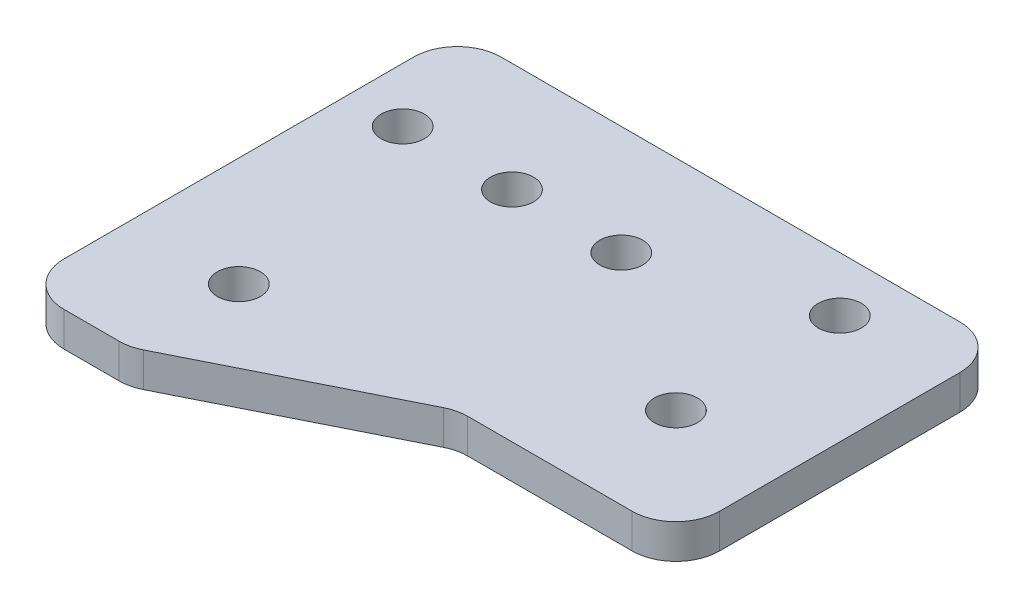
ISO-10303-21;
HEADER;
FILE_DESCRIPTION(('STEP AP214'),'2;1');
FILE_NAME('part.step','',(''),(''),'','','');
FILE_SCHEMA(('AUTOMOTIVE_DESIGN { 1 0 10303 214 1 1 1 1 }'));
ENDSEC;
DATA;
#1=APPLICATION_CONTEXT('core data for automotive mechanical design processes');
#2=APPLICATION_PROTOCOL_DEFINITION('international standard','automotive_design',2000,#1);
#3=PRODUCT_CONTEXT('',#1,'mechanical');
#4=PRODUCT('Part','Part','',(#3));
#5=PRODUCT_RELATED_PRODUCT_CATEGORY('part','',(#4));
#6=PRODUCT_DEFINITION_FORMATION('','',#4);
#7=PRODUCT_DEFINITION_CONTEXT('part definition',#1,'design');
#8=PRODUCT_DEFINITION('design','',#6,#7);
#9=PRODUCT_DEFINITION_SHAPE('','',#8);
#10=(LENGTH_UNIT() NAMED_UNIT(*) SI_UNIT(.MILLI.,.METRE.));
#11=(NAMED_UNIT(*) PLANE_ANGLE_UNIT() SI_UNIT($,.RADIAN.));
#12=(NAMED_UNIT(*) SI_UNIT($,.STERADIAN.) SOLID_ANGLE_UNIT());
#13=UNCERTAINTY_MEASURE_WITH_UNIT(LENGTH_MEASURE(1.E-05),#10,'distance_accuracy_value','');
#14=(GEOMETRIC_REPRESENTATION_CONTEXT(3) GLOBAL_UNCERTAINTY_ASSIGNED_CONTEXT((#13)) GLOBAL_UNIT_ASSIGNED_CONTEXT((#10,
#11,#12)) REPRESENTATION_CONTEXT('',''));
#15=CARTESIAN_POINT('',(0.,0.,0.));
#16=DIRECTION('',(0.,0.,1.));
#17=DIRECTION('',(1.,0.,0.));
#18=AXIS2_PLACEMENT_3D('',#15,#16,#17);
#19=CARTESIAN_POINT('',(63.5,-3.99999999999999,0.));
#20=DIRECTION('',(-1.,0.,0.));
#21=DIRECTION('',(0.,-1.,0.));
#22=AXIS2_PLACEMENT_3D('',#19,#20,#21);
#23=PLANE('',#22);
#24=DIRECTION('',(0.,0.,1.));
#25=VECTOR('',#24,1.);
#26=CARTESIAN_POINT('',(63.5,0.,0.));
#27=LINE('',#26,#25);
#28=CARTESIAN_POINT('',(63.5,0.,5.07999999999999));
#29=VERTEX_POINT('',#28);
#30=CARTESIAN_POINT('',(63.5,0.,45.7199999999998));
#31=VERTEX_POINT('',#30);
#32=EDGE_CURVE('E162',#29,#31,#27,.T.);
#33=ORIENTED_EDGE('',*,*,#32,.F.);
#34=DIRECTION('',(0.,1.,0.));
#35=VECTOR('',#34,1.);
#36=CARTESIAN_POINT('',(63.5,-3.99999999999999,5.07999999999999));
#37=LINE('',#36,#35);
#38=CARTESIAN_POINT('',(63.5,-3.99999999999999,5.07999999999999));
#39=VERTEX_POINT('',#38);
#40=EDGE_CURVE('E251',#29,#39,#37,.F.);
#41=ORIENTED_EDGE('',*,*,#40,.T.);
#42=DIRECTION('',(0.,0.,1.));
#43=VECTOR('',#42,1.);
#44=CARTESIAN_POINT('',(63.5,-3.99999999999999,0.));
#45=LINE('',#44,#43);
#46=CARTESIAN_POINT('',(63.5,-3.99999999999999,45.7199999999998));
#47=VERTEX_POINT('',#46);
#48=EDGE_CURVE('E344',#39,#47,#45,.T.);
#49=ORIENTED_EDGE('',*,*,#48,.T.);
#50=DIRECTION('',(0.,1.,0.));
#51=VECTOR('',#50,1.);
#52=CARTESIAN_POINT('',(63.5,-3.99999999999999,45.7199999999998));
#53=LINE('',#52,#51);
#54=EDGE_CURVE('E248',#47,#31,#53,.T.);
#55=ORIENTED_EDGE('',*,*,#54,.T.);
#56=EDGE_LOOP('',(#33,#41,#49,#55));
#57=FACE_BOUND('',#56,.T.);
#58=ADVANCED_FACE('F41',(#57),#23,.T.);
#59=CARTESIAN_POINT('',(0.,-4.,2.11038501011372E-13));
#60=DIRECTION('',(0.,0.,1.));
#61=DIRECTION('',(1.,0.,0.));
#62=AXIS2_PLACEMENT_3D('',#59,#60,#61);
#63=PLANE('',#62);
#64=DIRECTION('',(1.,0.,0.));
#65=VECTOR('',#64,1.);
#66=CARTESIAN_POINT('',(0.,0.,2.11038501011372E-13));
#67=LINE('',#66,#65);
#68=CARTESIAN_POINT('',(68.58,0.,0.));
#69=VERTEX_POINT('',#68);
#70=CARTESIAN_POINT('',(121.92,0.,-1.74745259022696E-13));
#71=VERTEX_POINT('',#70);
#72=EDGE_CURVE('E309',#69,#71,#67,.T.);
#73=ORIENTED_EDGE('',*,*,#72,.T.);
#74=DIRECTION('',(0.,1.,0.));
#75=VECTOR('',#74,1.);
#76=CARTESIAN_POINT('',(121.92,-3.99999999999998,-1.74745259022696E-13));
#77=LINE('',#76,#75);
#78=CARTESIAN_POINT('',(121.92,-3.99999999999998,-1.74745259022696E-13));
#79=VERTEX_POINT('',#78);
#80=EDGE_CURVE('E245',#71,#79,#77,.F.);
#81=ORIENTED_EDGE('',*,*,#80,.T.);
#82=DIRECTION('',(1.,0.,0.));
#83=VECTOR('',#82,1.);
#84=CARTESIAN_POINT('',(0.,-4.,2.11038501011372E-13));
#85=LINE('',#84,#83);
#86=CARTESIAN_POINT('',(68.58,-3.99999999999999,0.));
#87=VERTEX_POINT('',#86);
#88=EDGE_CURVE('E348',#87,#79,#85,.T.);
#89=ORIENTED_EDGE('',*,*,#88,.F.);
#90=DIRECTION('',(0.,1.,0.));
#91=VECTOR('',#90,1.);
#92=CARTESIAN_POINT('',(68.58,0.,0.));
#93=LINE('',#92,#91);
#94=EDGE_CURVE('E241',#87,#69,#93,.T.);
#95=ORIENTED_EDGE('',*,*,#94,.T.);
#96=EDGE_LOOP('',(#73,#81,#89,#95));
#97=FACE_BOUND('',#96,.T.);
#98=ADVANCED_FACE('F365',(#97),#63,.F.);
#99=CARTESIAN_POINT('',(127.,-3.99999999999998,0.));
#100=DIRECTION('',(-1.,0.,0.));
#101=DIRECTION('',(0.,-1.,0.));
#102=AXIS2_PLACEMENT_3D('',#99,#100,#101);
#103=PLANE('',#102);
#104=DIRECTION('',(0.,0.,1.));
#105=VECTOR('',#104,1.);
#106=CARTESIAN_POINT('',(127.,0.,0.));
#107=LINE('',#106,#105);
#108=CARTESIAN_POINT('',(127.,0.,5.07999999999983));
#109=VERTEX_POINT('',#108);
#110=CARTESIAN_POINT('',(127.,0.,33.02));
#111=VERTEX_POINT('',#110);
#112=EDGE_CURVE('E264',#109,#111,#107,.T.);
#113=ORIENTED_EDGE('',*,*,#112,.T.);
#114=DIRECTION('',(0.,1.,0.));
#115=VECTOR('',#114,1.);
#116=CARTESIAN_POINT('',(127.,-3.99999999999998,33.02));
#117=LINE('',#116,#115);
#118=CARTESIAN_POINT('',(127.,-3.99999999999998,33.02));
#119=VERTEX_POINT('',#118);
#120=EDGE_CURVE('E238',#111,#119,#117,.F.);
#121=ORIENTED_EDGE('',*,*,#120,.T.);
#122=DIRECTION('',(0.,0.,1.));
#123=VECTOR('',#122,1.);
#124=CARTESIAN_POINT('',(127.,-3.99999999999998,0.));
#125=LINE('',#124,#123);
#126=CARTESIAN_POINT('',(127.,-3.99999999999998,5.07999999999983));
#127=VERTEX_POINT('',#126);
#128=EDGE_CURVE('E286',#127,#119,#125,.T.);
#129=ORIENTED_EDGE('',*,*,#128,.F.);
#130=DIRECTION('',(0.,1.,0.));
#131=VECTOR('',#130,1.);
#132=CARTESIAN_POINT('',(127.,-3.99999999999998,5.07999999999983));
#133=LINE('',#132,#131);
#134=EDGE_CURVE('E234',#127,#109,#133,.T.);
#135=ORIENTED_EDGE('',*,*,#134,.T.);
#136=EDGE_LOOP('',(#113,#121,#129,#135));
#137=FACE_BOUND('',#136,.T.);
#138=ADVANCED_FACE('F359',(#137),#103,.F.);
#139=CARTESIAN_POINT('',(0.,-4.,38.1));
#140=DIRECTION('',(0.,0.,1.));
#141=DIRECTION('',(0.,-1.,0.));
#142=AXIS2_PLACEMENT_3D('',#139,#140,#141);
#143=PLANE('',#142);
#144=DIRECTION('',(1.,0.,0.));
#145=VECTOR('',#144,1.);
#146=CARTESIAN_POINT('',(0.,0.,38.1));
#147=LINE('',#146,#145);
#148=CARTESIAN_POINT('',(102.799225325699,0.,38.1));
#149=VERTEX_POINT('',#148);
#150=CARTESIAN_POINT('',(121.92,0.,38.1));
#151=VERTEX_POINT('',#150);
#152=EDGE_CURVE('E257',#149,#151,#147,.T.);
#153=ORIENTED_EDGE('',*,*,#152,.F.);
#154=DIRECTION('',(0.,1.,0.));
#155=VECTOR('',#154,1.);
#156=CARTESIAN_POINT('',(102.799225325699,-3.99999999999999,38.1));
#157=LINE('',#156,#155);
#158=CARTESIAN_POINT('',(102.799225325699,-3.99999999999999,38.1));
#159=VERTEX_POINT('',#158);
#160=EDGE_CURVE('E70',#149,#159,#157,.F.);
#161=ORIENTED_EDGE('',*,*,#160,.T.);
#162=DIRECTION('',(1.,0.,0.));
#163=VECTOR('',#162,1.);
#164=CARTESIAN_POINT('',(0.,-4.,38.1));
#165=LINE('',#164,#163);
#166=CARTESIAN_POINT('',(121.92,-3.99999999999998,38.1));
#167=VERTEX_POINT('',#166);
#168=EDGE_CURVE('E274',#159,#167,#165,.T.);
#169=ORIENTED_EDGE('',*,*,#168,.T.);
#170=DIRECTION('',(0.,1.,0.));
#171=VECTOR('',#170,1.);
#172=CARTESIAN_POINT('',(121.92,0.,38.1));
#173=LINE('',#172,#171);
#174=EDGE_CURVE('E228',#167,#151,#173,.T.);
#175=ORIENTED_EDGE('',*,*,#174,.T.);
#176=EDGE_LOOP('',(#153,#161,#169,#175));
#177=FACE_BOUND('',#176,.T.);
#178=ADVANCED_FACE('F261',(#177),#143,.T.);
#179=CARTESIAN_POINT('',(35.5599999999995,-3.99999999999999,71.1199999999999));
#180=DIRECTION('',(0.447213595499953,0.,0.894427190999918));
#181=DIRECTION('',(0.894427190999918,0.,-0.447213595499953));
#182=AXIS2_PLACEMENT_3D('',#179,#180,#181);
#183=PLANE('',#182);
#184=DIRECTION('',(0.894427190999918,0.,-0.447213595499953));
#185=VECTOR('',#184,1.);
#186=CARTESIAN_POINT('',(35.5599999999995,0.,71.1199999999999));
#187=LINE('',#186,#185);
#188=CARTESIAN_POINT('',(77.2726197394409,0.,50.2636901302794));
#189=VERTEX_POINT('',#188);
#190=CARTESIAN_POINT('',(100.527380260559,0.,38.6363098697204));
#191=VERTEX_POINT('',#190);
#192=EDGE_CURVE('E180',#189,#191,#187,.T.);
#193=ORIENTED_EDGE('',*,*,#192,.F.);
#194=DIRECTION('',(0.,1.,0.));
#195=VECTOR('',#194,1.);
#196=CARTESIAN_POINT('',(77.2726197394409,-3.99999999999999,50.2636901302794));
#197=LINE('',#196,#195);
#198=CARTESIAN_POINT('',(77.2726197394409,-3.99999999999999,50.2636901302794));
#199=VERTEX_POINT('',#198);
#200=EDGE_CURVE('E212',#189,#199,#197,.F.);
#201=ORIENTED_EDGE('',*,*,#200,.T.);
#202=DIRECTION('',(0.894427190999918,0.,-0.447213595499953));
#203=VECTOR('',#202,1.);
#204=CARTESIAN_POINT('',(35.5599999999995,-3.99999999999999,71.1199999999999));
#205=LINE('',#204,#203);
#206=CARTESIAN_POINT('',(100.527380260559,-3.99999999999999,38.6363098697204));
#207=VERTEX_POINT('',#206);
#208=EDGE_CURVE('E272',#199,#207,#205,.T.);
#209=ORIENTED_EDGE('',*,*,#208,.T.);
#210=DIRECTION('',(0.,1.,0.));
#211=VECTOR('',#210,1.);
#212=CARTESIAN_POINT('',(100.527380260559,0.,38.6363098697204));
#213=LINE('',#212,#211);
#214=EDGE_CURVE('E208',#207,#191,#213,.T.);
#215=ORIENTED_EDGE('',*,*,#214,.T.);
#216=EDGE_LOOP('',(#193,#201,#209,#215));
#217=FACE_BOUND('',#216,.T.);
#218=ADVANCED_FACE('F276',(#217),#183,.T.);
#219=CARTESIAN_POINT('',(114.3,-3.99999999999998,25.4));
#220=DIRECTION('',(0.,1.,0.));
#221=DIRECTION('',(-1.,0.,0.));
#222=AXIS2_PLACEMENT_3D('',#219,#220,#221);
#223=CYLINDRICAL_SURFACE('',#222,2.5);
#224=CARTESIAN_POINT('',(114.3,-3.99999999999998,25.4));
#225=DIRECTION('',(0.,-1.,0.));
#226=DIRECTION('',(1.,0.,0.));
#227=AXIS2_PLACEMENT_3D('',#224,#225,#226);
#228=CIRCLE('',#227,2.5);
#229=CARTESIAN_POINT('',(116.8,-3.99999999999998,25.4));
#230=VERTEX_POINT('',#229);
#231=EDGE_CURVE('E191',#230,#230,#228,.T.);
#232=ORIENTED_EDGE('',*,*,#231,.T.);
#233=EDGE_LOOP('',(#232));
#234=FACE_BOUND('',#233,.T.);
#235=CARTESIAN_POINT('',(114.3,0.,25.4));
#236=DIRECTION('',(0.,-1.,0.));
#237=DIRECTION('',(1.,0.,0.));
#238=AXIS2_PLACEMENT_3D('',#235,#236,#237);
#239=CIRCLE('',#238,2.5);
#240=CARTESIAN_POINT('',(116.8,0.,25.4));
#241=VERTEX_POINT('',#240);
#242=EDGE_CURVE('E319',#241,#241,#239,.T.);
#243=ORIENTED_EDGE('',*,*,#242,.F.);
#244=EDGE_LOOP('',(#243));
#245=FACE_BOUND('',#244,.T.);
#246=ADVANCED_FACE('F426',(#234,#245),#223,.F.);
#247=CARTESIAN_POINT('',(76.2,-3.99999999999999,38.1));
#248=DIRECTION('',(0.,1.,0.));
#249=DIRECTION('',(-1.,0.,0.));
#250=AXIS2_PLACEMENT_3D('',#247,#248,#249);
#251=CYLINDRICAL_SURFACE('',#250,2.5);
#252=CARTESIAN_POINT('',(76.2,-3.99999999999999,38.1));
#253=DIRECTION('',(0.,-1.,0.));
#254=DIRECTION('',(1.,0.,0.));
#255=AXIS2_PLACEMENT_3D('',#252,#253,#254);
#256=CIRCLE('',#255,2.5);
#257=CARTESIAN_POINT('',(78.7,-3.99999999999999,38.1));
#258=VERTEX_POINT('',#257);
#259=EDGE_CURVE('E283',#258,#258,#256,.T.);
#260=ORIENTED_EDGE('',*,*,#259,.T.);
#261=EDGE_LOOP('',(#260));
#262=FACE_BOUND('',#261,.T.);
#263=CARTESIAN_POINT('',(76.2,0.,38.1));
#264=DIRECTION('',(0.,-1.,0.));
#265=DIRECTION('',(1.,0.,0.));
#266=AXIS2_PLACEMENT_3D('',#263,#264,#265);
#267=CIRCLE('',#266,2.5);
#268=CARTESIAN_POINT('',(78.7,0.,38.1));
#269=VERTEX_POINT('',#268);
#270=EDGE_CURVE('E179',#269,#269,#267,.T.);
#271=ORIENTED_EDGE('',*,*,#270,.F.);
#272=EDGE_LOOP('',(#271));
#273=FACE_BOUND('',#272,.T.);
#274=ADVANCED_FACE('F428',(#262,#273),#251,.F.);
#275=CARTESIAN_POINT('',(0.,-4.,50.7999999999999));
#276=DIRECTION('',(0.,0.,1.));
#277=DIRECTION('',(0.,-1.,0.));
#278=AXIS2_PLACEMENT_3D('',#275,#276,#277);
#279=PLANE('',#278);
#280=DIRECTION('',(1.,0.,0.));
#281=VECTOR('',#280,1.);
#282=CARTESIAN_POINT('',(0.,-4.,50.7999999999999));
#283=LINE('',#282,#281);
#284=CARTESIAN_POINT('',(68.58,-3.99999999999999,50.7999999999999));
#285=VERTEX_POINT('',#284);
#286=CARTESIAN_POINT('',(75.0007746743012,-3.99999999999999,50.7999999999999));
#287=VERTEX_POINT('',#286);
#288=EDGE_CURVE('E279',#285,#287,#283,.T.);
#289=ORIENTED_EDGE('',*,*,#288,.T.);
#290=DIRECTION('',(0.,1.,0.));
#291=VECTOR('',#290,1.);
#292=CARTESIAN_POINT('',(75.0007746743012,-3.99999999999999,50.7999999999999));
#293=LINE('',#292,#291);
#294=CARTESIAN_POINT('',(75.0007746743012,0.,50.7999999999999));
#295=VERTEX_POINT('',#294);
#296=EDGE_CURVE('E169',#287,#295,#293,.T.);
#297=ORIENTED_EDGE('',*,*,#296,.T.);
#298=DIRECTION('',(1.,0.,0.));
#299=VECTOR('',#298,1.);
#300=CARTESIAN_POINT('',(0.,0.,50.7999999999999));
#301=LINE('',#300,#299);
#302=CARTESIAN_POINT('',(68.58,0.,50.7999999999999));
#303=VERTEX_POINT('',#302);
#304=EDGE_CURVE('E160',#303,#295,#301,.T.);
#305=ORIENTED_EDGE('',*,*,#304,.F.);
#306=DIRECTION('',(0.,1.,0.));
#307=VECTOR('',#306,1.);
#308=CARTESIAN_POINT('',(68.58,-3.99999999999999,50.7999999999999));
#309=LINE('',#308,#307);
#310=EDGE_CURVE('E175',#303,#285,#309,.F.);
#311=ORIENTED_EDGE('',*,*,#310,.T.);
#312=EDGE_LOOP('',(#289,#297,#305,#311));
#313=FACE_BOUND('',#312,.T.);
#314=ADVANCED_FACE('F174',(#313),#279,.T.);
#315=CARTESIAN_POINT('',(69.85,-3.99999999999999,12.6999999999999));
#316=DIRECTION('',(0.,1.,0.));
#317=DIRECTION('',(-1.,0.,0.));
#318=AXIS2_PLACEMENT_3D('',#315,#316,#317);
#319=CYLINDRICAL_SURFACE('',#318,2.5);
#320=CARTESIAN_POINT('',(69.85,-3.99999999999999,12.6999999999999));
#321=DIRECTION('',(0.,-1.,0.));
#322=DIRECTION('',(1.,0.,0.));
#323=AXIS2_PLACEMENT_3D('',#320,#321,#322);
#324=CIRCLE('',#323,2.5);
#325=CARTESIAN_POINT('',(72.35,-3.99999999999999,12.6999999999999));
#326=VERTEX_POINT('',#325);
#327=EDGE_CURVE('E338',#326,#326,#324,.T.);
#328=ORIENTED_EDGE('',*,*,#327,.T.);
#329=EDGE_LOOP('',(#328));
#330=FACE_BOUND('',#329,.T.);
#331=CARTESIAN_POINT('',(69.85,0.,12.6999999999999));
#332=DIRECTION('',(0.,-1.,0.));
#333=DIRECTION('',(1.,0.,0.));
#334=AXIS2_PLACEMENT_3D('',#331,#332,#333);
#335=CIRCLE('',#334,2.5);
#336=CARTESIAN_POINT('',(72.35,0.,12.6999999999999));
#337=VERTEX_POINT('',#336);
#338=EDGE_CURVE('E303',#337,#337,#335,.T.);
#339=ORIENTED_EDGE('',*,*,#338,.F.);
#340=EDGE_LOOP('',(#339));
#341=FACE_BOUND('',#340,.T.);
#342=ADVANCED_FACE('F395',(#330,#341),#319,.F.);
#343=CARTESIAN_POINT('',(82.55,-3.99999999999999,12.6999999999999));
#344=DIRECTION('',(0.,1.,0.));
#345=DIRECTION('',(-1.,0.,0.));
#346=AXIS2_PLACEMENT_3D('',#343,#344,#345);
#347=CYLINDRICAL_SURFACE('',#346,2.5);
#348=CARTESIAN_POINT('',(82.55,-3.99999999999999,12.6999999999999));
#349=DIRECTION('',(0.,-1.,0.));
#350=DIRECTION('',(1.,0.,0.));
#351=AXIS2_PLACEMENT_3D('',#348,#349,#350);
#352=CIRCLE('',#351,2.5);
#353=CARTESIAN_POINT('',(85.05,-3.99999999999999,12.6999999999999));
#354=VERTEX_POINT('',#353);
#355=EDGE_CURVE('E332',#354,#354,#352,.T.);
#356=ORIENTED_EDGE('',*,*,#355,.T.);
#357=EDGE_LOOP('',(#356));
#358=FACE_BOUND('',#357,.T.);
#359=CARTESIAN_POINT('',(82.55,0.,12.6999999999999));
#360=DIRECTION('',(0.,-1.,0.));
#361=DIRECTION('',(1.,0.,0.));
#362=AXIS2_PLACEMENT_3D('',#359,#360,#361);
#363=CIRCLE('',#362,2.5);
#364=CARTESIAN_POINT('',(85.05,0.,12.6999999999999));
#365=VERTEX_POINT('',#364);
#366=EDGE_CURVE('E300',#365,#365,#363,.T.);
#367=ORIENTED_EDGE('',*,*,#366,.F.);
#368=EDGE_LOOP('',(#367));
#369=FACE_BOUND('',#368,.T.);
#370=ADVANCED_FACE('F398',(#358,#369),#347,.F.);
#371=CARTESIAN_POINT('',(95.25,-3.99999999999999,12.6999999999999));
#372=DIRECTION('',(0.,1.,0.));
#373=DIRECTION('',(-1.,0.,0.));
#374=AXIS2_PLACEMENT_3D('',#371,#372,#373);
#375=CYLINDRICAL_SURFACE('',#374,2.5);
#376=CARTESIAN_POINT('',(95.25,-3.99999999999999,12.6999999999999));
#377=DIRECTION('',(0.,-1.,0.));
#378=DIRECTION('',(1.,0.,0.));
#379=AXIS2_PLACEMENT_3D('',#376,#377,#378);
#380=CIRCLE('',#379,2.5);
#381=CARTESIAN_POINT('',(97.75,-3.99999999999999,12.6999999999999));
#382=VERTEX_POINT('',#381);
#383=EDGE_CURVE('E327',#382,#382,#380,.T.);
#384=ORIENTED_EDGE('',*,*,#383,.T.);
#385=EDGE_LOOP('',(#384));
#386=FACE_BOUND('',#385,.T.);
#387=CARTESIAN_POINT('',(95.25,0.,12.6999999999999));
#388=DIRECTION('',(0.,-1.,0.));
#389=DIRECTION('',(1.,0.,0.));
#390=AXIS2_PLACEMENT_3D('',#387,#388,#389);
#391=CIRCLE('',#390,2.5);
#392=CARTESIAN_POINT('',(97.75,0.,12.6999999999999));
#393=VERTEX_POINT('',#392);
#394=EDGE_CURVE('E296',#393,#393,#391,.T.);
#395=ORIENTED_EDGE('',*,*,#394,.F.);
#396=EDGE_LOOP('',(#395));
#397=FACE_BOUND('',#396,.T.);
#398=ADVANCED_FACE('F401',(#386,#397),#375,.F.);
#399=CARTESIAN_POINT('',(114.3,-3.99999999999998,6.35000000000001));
#400=DIRECTION('',(0.,1.,0.));
#401=DIRECTION('',(-1.,0.,0.));
#402=AXIS2_PLACEMENT_3D('',#399,#400,#401);
#403=CYLINDRICAL_SURFACE('',#402,2.5);
#404=CARTESIAN_POINT('',(114.3,-3.99999999999998,6.35000000000001));
#405=DIRECTION('',(0.,-1.,0.));
#406=DIRECTION('',(1.,0.,0.));
#407=AXIS2_PLACEMENT_3D('',#404,#405,#406);
#408=CIRCLE('',#407,2.5);
#409=CARTESIAN_POINT('',(116.8,-3.99999999999998,6.35000000000001));
#410=VERTEX_POINT('',#409);
#411=EDGE_CURVE('E185',#410,#410,#408,.T.);
#412=ORIENTED_EDGE('',*,*,#411,.T.);
#413=EDGE_LOOP('',(#412));
#414=FACE_BOUND('',#413,.T.);
#415=CARTESIAN_POINT('',(114.3,0.,6.35000000000001));
#416=DIRECTION('',(0.,-1.,0.));
#417=DIRECTION('',(1.,0.,0.));
#418=AXIS2_PLACEMENT_3D('',#415,#416,#417);
#419=CIRCLE('',#418,2.5);
#420=CARTESIAN_POINT('',(116.8,0.,6.35000000000001));
#421=VERTEX_POINT('',#420);
#422=EDGE_CURVE('E194',#421,#421,#419,.T.);
#423=ORIENTED_EDGE('',*,*,#422,.F.);
#424=EDGE_LOOP('',(#423));
#425=FACE_BOUND('',#424,.T.);
#426=ADVANCED_FACE('F404',(#414,#425),#403,.F.);
#427=CARTESIAN_POINT('',(0.,-4.,0.));
#428=DIRECTION('',(0.,-1.,0.));
#429=DIRECTION('',(1.,0.,0.));
#430=AXIS2_PLACEMENT_3D('',#427,#428,#429);
#431=PLANE('',#430);
#432=ORIENTED_EDGE('',*,*,#383,.F.);
#433=EDGE_LOOP('',(#432));
#434=FACE_BOUND('',#433,.T.);
#435=ORIENTED_EDGE('',*,*,#355,.F.);
#436=EDGE_LOOP('',(#435));
#437=FACE_BOUND('',#436,.T.);
#438=ORIENTED_EDGE('',*,*,#327,.F.);
#439=EDGE_LOOP('',(#438));
#440=FACE_BOUND('',#439,.T.);
#441=ORIENTED_EDGE('',*,*,#208,.F.);
#442=CARTESIAN_POINT('',(75.0007746743012,-3.99999999999999,45.7199999999998));
#443=DIRECTION('',(0.,-1.,0.));
#444=DIRECTION('',(1.,0.,0.));
#445=AXIS2_PLACEMENT_3D('',#442,#443,#444);
#446=CIRCLE('',#445,5.08);
#447=EDGE_CURVE('E225',#199,#287,#446,.T.);
#448=ORIENTED_EDGE('',*,*,#447,.T.);
#449=ORIENTED_EDGE('',*,*,#288,.F.);
#450=CARTESIAN_POINT('',(68.58,-3.99999999999999,45.7199999999998));
#451=DIRECTION('',(0.,-1.,0.));
#452=DIRECTION('',(1.,0.,0.));
#453=AXIS2_PLACEMENT_3D('',#450,#451,#452);
#454=CIRCLE('',#453,5.08);
#455=EDGE_CURVE('E183',#285,#47,#454,.T.);
#456=ORIENTED_EDGE('',*,*,#455,.T.);
#457=ORIENTED_EDGE('',*,*,#48,.F.);
#458=CARTESIAN_POINT('',(68.58,-3.99999999999999,5.07999999999999));
#459=DIRECTION('',(0.,-1.,0.));
#460=DIRECTION('',(1.,0.,0.));
#461=AXIS2_PLACEMENT_3D('',#458,#459,#460);
#462=CIRCLE('',#461,5.08);
#463=EDGE_CURVE('E217',#39,#87,#462,.T.);
#464=ORIENTED_EDGE('',*,*,#463,.T.);
#465=ORIENTED_EDGE('',*,*,#88,.T.);
#466=CARTESIAN_POINT('',(121.92,-3.99999999999998,5.07999999999983));
#467=DIRECTION('',(0.,-1.,0.));
#468=DIRECTION('',(1.,0.,0.));
#469=AXIS2_PLACEMENT_3D('',#466,#467,#468);
#470=CIRCLE('',#469,5.08);
#471=EDGE_CURVE('E220',#79,#127,#470,.T.);
#472=ORIENTED_EDGE('',*,*,#471,.T.);
#473=ORIENTED_EDGE('',*,*,#128,.T.);
#474=CARTESIAN_POINT('',(121.92,-3.99999999999998,33.02));
#475=DIRECTION('',(0.,-1.,0.));
#476=DIRECTION('',(1.,0.,0.));
#477=AXIS2_PLACEMENT_3D('',#474,#475,#476);
#478=CIRCLE('',#477,5.08);
#479=EDGE_CURVE('E60',#119,#167,#478,.T.);
#480=ORIENTED_EDGE('',*,*,#479,.T.);
#481=ORIENTED_EDGE('',*,*,#168,.F.);
#482=CARTESIAN_POINT('',(102.799225325699,-3.99999999999999,43.18));
#483=DIRECTION('',(0.,-1.,0.));
#484=DIRECTION('',(1.,0.,0.));
#485=AXIS2_PLACEMENT_3D('',#482,#483,#484);
#486=CIRCLE('',#485,5.08);
#487=EDGE_CURVE('E11',#159,#207,#486,.F.);
#488=ORIENTED_EDGE('',*,*,#487,.T.);
#489=EDGE_LOOP('',(#441,#448,#449,#456,#457,#464,#465,#472,#473,#480,#481,#488));
#490=FACE_BOUND('',#489,.T.);
#491=ORIENTED_EDGE('',*,*,#259,.F.);
#492=EDGE_LOOP('',(#491));
#493=FACE_BOUND('',#492,.T.);
#494=ORIENTED_EDGE('',*,*,#231,.F.);
#495=EDGE_LOOP('',(#494));
#496=FACE_BOUND('',#495,.T.);
#497=ORIENTED_EDGE('',*,*,#411,.F.);
#498=EDGE_LOOP('',(#497));
#499=FACE_BOUND('',#498,.T.);
#500=ADVANCED_FACE('F270',(#434,#437,#440,#490,#493,#496,#499),#431,.T.);
#501=CARTESIAN_POINT('',(0.,0.,0.));
#502=DIRECTION('',(0.,-1.,0.));
#503=DIRECTION('',(1.,0.,0.));
#504=AXIS2_PLACEMENT_3D('',#501,#502,#503);
#505=PLANE('',#504);
#506=ORIENTED_EDGE('',*,*,#394,.T.);
#507=EDGE_LOOP('',(#506));
#508=FACE_BOUND('',#507,.T.);
#509=ORIENTED_EDGE('',*,*,#366,.T.);
#510=EDGE_LOOP('',(#509));
#511=FACE_BOUND('',#510,.T.);
#512=ORIENTED_EDGE('',*,*,#338,.T.);
#513=EDGE_LOOP('',(#512));
#514=FACE_BOUND('',#513,.T.);
#515=ORIENTED_EDGE('',*,*,#304,.T.);
#516=CARTESIAN_POINT('',(75.0007746743012,0.,45.7199999999998));
#517=DIRECTION('',(0.,-1.,0.));
#518=DIRECTION('',(1.,0.,0.));
#519=AXIS2_PLACEMENT_3D('',#516,#517,#518);
#520=CIRCLE('',#519,5.08);
#521=EDGE_CURVE('E205',#295,#189,#520,.F.);
#522=ORIENTED_EDGE('',*,*,#521,.T.);
#523=ORIENTED_EDGE('',*,*,#192,.T.);
#524=CARTESIAN_POINT('',(102.799225325699,0.,43.18));
#525=DIRECTION('',(0.,-1.,0.));
#526=DIRECTION('',(1.,0.,0.));
#527=AXIS2_PLACEMENT_3D('',#524,#525,#526);
#528=CIRCLE('',#527,5.08);
#529=EDGE_CURVE('E50',#191,#149,#528,.T.);
#530=ORIENTED_EDGE('',*,*,#529,.T.);
#531=ORIENTED_EDGE('',*,*,#152,.T.);
#532=CARTESIAN_POINT('',(121.92,0.,33.02));
#533=DIRECTION('',(0.,-1.,0.));
#534=DIRECTION('',(1.,0.,0.));
#535=AXIS2_PLACEMENT_3D('',#532,#533,#534);
#536=CIRCLE('',#535,5.08);
#537=EDGE_CURVE('E202',#151,#111,#536,.F.);
#538=ORIENTED_EDGE('',*,*,#537,.T.);
#539=ORIENTED_EDGE('',*,*,#112,.F.);
#540=CARTESIAN_POINT('',(121.92,0.,5.07999999999983));
#541=DIRECTION('',(0.,-1.,0.));
#542=DIRECTION('',(1.,0.,0.));
#543=AXIS2_PLACEMENT_3D('',#540,#541,#542);
#544=CIRCLE('',#543,5.08);
#545=EDGE_CURVE('E199',#109,#71,#544,.F.);
#546=ORIENTED_EDGE('',*,*,#545,.T.);
#547=ORIENTED_EDGE('',*,*,#72,.F.);
#548=CARTESIAN_POINT('',(68.58,0.,5.07999999999999));
#549=DIRECTION('',(0.,-1.,0.));
#550=DIRECTION('',(1.,0.,0.));
#551=AXIS2_PLACEMENT_3D('',#548,#549,#550);
#552=CIRCLE('',#551,5.08);
#553=EDGE_CURVE('E168',#69,#29,#552,.F.);
#554=ORIENTED_EDGE('',*,*,#553,.T.);
#555=ORIENTED_EDGE('',*,*,#32,.T.);
#556=CARTESIAN_POINT('',(68.58,0.,45.7199999999998));
#557=DIRECTION('',(0.,-1.,0.));
#558=DIRECTION('',(1.,0.,0.));
#559=AXIS2_PLACEMENT_3D('',#556,#557,#558);
#560=CIRCLE('',#559,5.08);
#561=EDGE_CURVE('E156',#31,#303,#560,.F.);
#562=ORIENTED_EDGE('',*,*,#561,.T.);
#563=EDGE_LOOP('',(#515,#522,#523,#530,#531,#538,#539,#546,#547,#554,#555,#562));
#564=FACE_BOUND('',#563,.T.);
#565=ORIENTED_EDGE('',*,*,#270,.T.);
#566=EDGE_LOOP('',(#565));
#567=FACE_BOUND('',#566,.T.);
#568=ORIENTED_EDGE('',*,*,#242,.T.);
#569=EDGE_LOOP('',(#568));
#570=FACE_BOUND('',#569,.T.);
#571=ORIENTED_EDGE('',*,*,#422,.T.);
#572=EDGE_LOOP('',(#571));
#573=FACE_BOUND('',#572,.T.);
#574=ADVANCED_FACE('F158',(#508,#511,#514,#564,#567,#570,#573),#505,.F.);
#575=CARTESIAN_POINT('',(75.0007746743012,-3.99999999999999,45.7199999999998));
#576=DIRECTION('',(0.,1.,0.));
#577=DIRECTION('',(-1.,0.,0.));
#578=AXIS2_PLACEMENT_3D('',#575,#576,#577);
#579=CYLINDRICAL_SURFACE('',#578,5.08);
#580=ORIENTED_EDGE('',*,*,#447,.F.);
#581=ORIENTED_EDGE('',*,*,#200,.F.);
#582=ORIENTED_EDGE('',*,*,#521,.F.);
#583=ORIENTED_EDGE('',*,*,#296,.F.);
#584=EDGE_LOOP('',(#580,#581,#582,#583));
#585=FACE_BOUND('',#584,.T.);
#586=ADVANCED_FACE('F375',(#585),#579,.T.);
#587=CARTESIAN_POINT('',(102.799225325699,-3.99999999999999,43.18));
#588=DIRECTION('',(0.,-1.,0.));
#589=DIRECTION('',(1.,0.,0.));
#590=AXIS2_PLACEMENT_3D('',#587,#588,#589);
#591=CYLINDRICAL_SURFACE('',#590,5.08);
#592=ORIENTED_EDGE('',*,*,#487,.F.);
#593=ORIENTED_EDGE('',*,*,#160,.F.);
#594=ORIENTED_EDGE('',*,*,#529,.F.);
#595=ORIENTED_EDGE('',*,*,#214,.F.);
#596=EDGE_LOOP('',(#592,#593,#594,#595));
#597=FACE_BOUND('',#596,.T.);
#598=ADVANCED_FACE('F267',(#597),#591,.F.);
#599=CARTESIAN_POINT('',(121.92,-3.99999999999998,33.02));
#600=DIRECTION('',(0.,-1.,0.));
#601=DIRECTION('',(1.,0.,0.));
#602=AXIS2_PLACEMENT_3D('',#599,#600,#601);
#603=CYLINDRICAL_SURFACE('',#602,5.08);
#604=ORIENTED_EDGE('',*,*,#479,.F.);
#605=ORIENTED_EDGE('',*,*,#120,.F.);
#606=ORIENTED_EDGE('',*,*,#537,.F.);
#607=ORIENTED_EDGE('',*,*,#174,.F.);
#608=EDGE_LOOP('',(#604,#605,#606,#607));
#609=FACE_BOUND('',#608,.T.);
#610=ADVANCED_FACE('F357',(#609),#603,.T.);
#611=CARTESIAN_POINT('',(121.92,-3.99999999999998,5.07999999999983));
#612=DIRECTION('',(0.,1.,0.));
#613=DIRECTION('',(-1.,0.,0.));
#614=AXIS2_PLACEMENT_3D('',#611,#612,#613);
#615=CYLINDRICAL_SURFACE('',#614,5.08);
#616=ORIENTED_EDGE('',*,*,#471,.F.);
#617=ORIENTED_EDGE('',*,*,#80,.F.);
#618=ORIENTED_EDGE('',*,*,#545,.F.);
#619=ORIENTED_EDGE('',*,*,#134,.F.);
#620=EDGE_LOOP('',(#616,#617,#618,#619));
#621=FACE_BOUND('',#620,.T.);
#622=ADVANCED_FACE('F361',(#621),#615,.T.);
#623=CARTESIAN_POINT('',(68.58,-3.99999999999999,5.07999999999999));
#624=DIRECTION('',(0.,-1.,0.));
#625=DIRECTION('',(1.,0.,0.));
#626=AXIS2_PLACEMENT_3D('',#623,#624,#625);
#627=CYLINDRICAL_SURFACE('',#626,5.08);
#628=ORIENTED_EDGE('',*,*,#463,.F.);
#629=ORIENTED_EDGE('',*,*,#40,.F.);
#630=ORIENTED_EDGE('',*,*,#553,.F.);
#631=ORIENTED_EDGE('',*,*,#94,.F.);
#632=EDGE_LOOP('',(#628,#629,#630,#631));
#633=FACE_BOUND('',#632,.T.);
#634=ADVANCED_FACE('F370',(#633),#627,.T.);
#635=CARTESIAN_POINT('',(68.58,-3.99999999999999,45.7199999999998));
#636=DIRECTION('',(0.,1.,0.));
#637=DIRECTION('',(-1.,0.,0.));
#638=AXIS2_PLACEMENT_3D('',#635,#636,#637);
#639=CYLINDRICAL_SURFACE('',#638,5.08);
#640=ORIENTED_EDGE('',*,*,#455,.F.);
#641=ORIENTED_EDGE('',*,*,#310,.F.);
#642=ORIENTED_EDGE('',*,*,#561,.F.);
#643=ORIENTED_EDGE('',*,*,#54,.F.);
#644=EDGE_LOOP('',(#640,#641,#642,#643));
#645=FACE_BOUND('',#644,.T.);
#646=ADVANCED_FACE('F43',(#645),#639,.T.);
#647=CLOSED_SHELL('',(#58,#98,#138,#178,#218,#246,#274,#314,#342,#370,#398,#426,#500,#574,#586,
#598,#610,#622,#634,#646));
#648=MANIFOLD_SOLID_BREP('B2',#647);
#649=ADVANCED_BREP_SHAPE_REPRESENTATION('',(#18,#648),#14);
#650=SHAPE_DEFINITION_REPRESENTATION(#9,#649);
ENDSEC;
END-ISO-10303-21;
